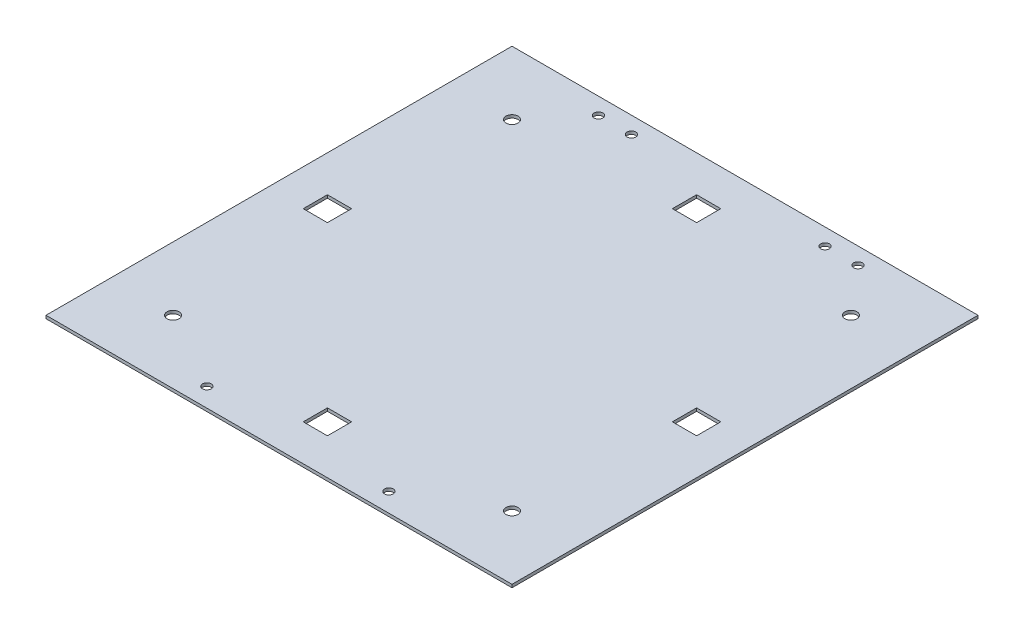
ISO-10303-21;
HEADER;
FILE_DESCRIPTION(('STEP AP214'),'2;1');
FILE_NAME('part.step','',(''),(''),'','','');
FILE_SCHEMA(('AUTOMOTIVE_DESIGN { 1 0 10303 214 1 1 1 1 }'));
ENDSEC;
DATA;
#1=APPLICATION_CONTEXT('core data for automotive mechanical design processes');
#2=APPLICATION_PROTOCOL_DEFINITION('international standard','automotive_design',2000,#1);
#3=PRODUCT_CONTEXT('',#1,'mechanical');
#4=PRODUCT('Part','Part','',(#3));
#5=PRODUCT_RELATED_PRODUCT_CATEGORY('part','',(#4));
#6=PRODUCT_DEFINITION_FORMATION('','',#4);
#7=PRODUCT_DEFINITION_CONTEXT('part definition',#1,'design');
#8=PRODUCT_DEFINITION('design','',#6,#7);
#9=PRODUCT_DEFINITION_SHAPE('','',#8);
#10=(LENGTH_UNIT() NAMED_UNIT(*) SI_UNIT(.MILLI.,.METRE.));
#11=(NAMED_UNIT(*) PLANE_ANGLE_UNIT() SI_UNIT($,.RADIAN.));
#12=(NAMED_UNIT(*) SI_UNIT($,.STERADIAN.) SOLID_ANGLE_UNIT());
#13=UNCERTAINTY_MEASURE_WITH_UNIT(LENGTH_MEASURE(1.E-05),#10,'distance_accuracy_value','');
#14=(GEOMETRIC_REPRESENTATION_CONTEXT(3) GLOBAL_UNCERTAINTY_ASSIGNED_CONTEXT((#13)) GLOBAL_UNIT_ASSIGNED_CONTEXT((#10,
#11,#12)) REPRESENTATION_CONTEXT('',''));
#15=CARTESIAN_POINT('',(0.,0.,0.));
#16=DIRECTION('',(0.,0.,1.));
#17=DIRECTION('',(1.,0.,0.));
#18=AXIS2_PLACEMENT_3D('',#15,#16,#17);
#19=CARTESIAN_POINT('',(0.,1.5875,0.));
#20=DIRECTION('',(1.,0.,0.));
#21=DIRECTION('',(0.,0.,-1.));
#22=AXIS2_PLACEMENT_3D('',#19,#20,#21);
#23=PLANE('',#22);
#24=DIRECTION('',(0.,0.,1.));
#25=VECTOR('',#24,1.);
#26=CARTESIAN_POINT('',(0.,0.,0.));
#27=LINE('',#26,#25);
#28=CARTESIAN_POINT('',(0.,0.,-244.475));
#29=VERTEX_POINT('',#28);
#30=CARTESIAN_POINT('',(0.,0.,0.));
#31=VERTEX_POINT('',#30);
#32=EDGE_CURVE('E334',#29,#31,#27,.T.);
#33=ORIENTED_EDGE('',*,*,#32,.T.);
#34=DIRECTION('',(0.,-1.,0.));
#35=VECTOR('',#34,1.);
#36=CARTESIAN_POINT('',(0.,1.5875,0.));
#37=LINE('',#36,#35);
#38=CARTESIAN_POINT('',(0.,1.5875,0.));
#39=VERTEX_POINT('',#38);
#40=EDGE_CURVE('E11',#39,#31,#37,.T.);
#41=ORIENTED_EDGE('',*,*,#40,.F.);
#42=DIRECTION('',(0.,0.,1.));
#43=VECTOR('',#42,1.);
#44=CARTESIAN_POINT('',(0.,1.5875,0.));
#45=LINE('',#44,#43);
#46=CARTESIAN_POINT('',(0.,1.5875,-244.475));
#47=VERTEX_POINT('',#46);
#48=EDGE_CURVE('E367',#47,#39,#45,.T.);
#49=ORIENTED_EDGE('',*,*,#48,.F.);
#50=DIRECTION('',(0.,-1.,0.));
#51=VECTOR('',#50,1.);
#52=CARTESIAN_POINT('',(0.,1.5875,-244.475));
#53=LINE('',#52,#51);
#54=EDGE_CURVE('E377',#47,#29,#53,.T.);
#55=ORIENTED_EDGE('',*,*,#54,.T.);
#56=EDGE_LOOP('',(#33,#41,#49,#55));
#57=FACE_BOUND('',#56,.T.);
#58=ADVANCED_FACE('F37',(#57),#23,.F.);
#59=CARTESIAN_POINT('',(0.,1.5875,0.));
#60=DIRECTION('',(0.,0.,-1.));
#61=DIRECTION('',(-1.,0.,0.));
#62=AXIS2_PLACEMENT_3D('',#59,#60,#61);
#63=PLANE('',#62);
#64=DIRECTION('',(1.,0.,0.));
#65=VECTOR('',#64,1.);
#66=CARTESIAN_POINT('',(0.,0.,0.));
#67=LINE('',#66,#65);
#68=CARTESIAN_POINT('',(244.475,0.,0.));
#69=VERTEX_POINT('',#68);
#70=EDGE_CURVE('E380',#31,#69,#67,.T.);
#71=ORIENTED_EDGE('',*,*,#70,.T.);
#72=DIRECTION('',(0.,-1.,0.));
#73=VECTOR('',#72,1.);
#74=CARTESIAN_POINT('',(244.475,1.5875,0.));
#75=LINE('',#74,#73);
#76=CARTESIAN_POINT('',(244.475,1.5875,0.));
#77=VERTEX_POINT('',#76);
#78=EDGE_CURVE('E44',#77,#69,#75,.T.);
#79=ORIENTED_EDGE('',*,*,#78,.F.);
#80=DIRECTION('',(1.,0.,0.));
#81=VECTOR('',#80,1.);
#82=CARTESIAN_POINT('',(0.,1.5875,0.));
#83=LINE('',#82,#81);
#84=EDGE_CURVE('E370',#39,#77,#83,.T.);
#85=ORIENTED_EDGE('',*,*,#84,.F.);
#86=ORIENTED_EDGE('',*,*,#40,.T.);
#87=EDGE_LOOP('',(#71,#79,#85,#86));
#88=FACE_BOUND('',#87,.T.);
#89=ADVANCED_FACE('F409',(#88),#63,.F.);
#90=CARTESIAN_POINT('',(244.475,1.5875,0.));
#91=DIRECTION('',(-1.,0.,0.));
#92=DIRECTION('',(0.,0.,1.));
#93=AXIS2_PLACEMENT_3D('',#90,#91,#92);
#94=PLANE('',#93);
#95=DIRECTION('',(0.,0.,-1.));
#96=VECTOR('',#95,1.);
#97=CARTESIAN_POINT('',(244.475,0.,0.));
#98=LINE('',#97,#96);
#99=CARTESIAN_POINT('',(244.475,0.,-244.475));
#100=VERTEX_POINT('',#99);
#101=EDGE_CURVE('E382',#69,#100,#98,.T.);
#102=ORIENTED_EDGE('',*,*,#101,.T.);
#103=DIRECTION('',(0.,-1.,0.));
#104=VECTOR('',#103,1.);
#105=CARTESIAN_POINT('',(244.475,1.5875,-244.475));
#106=LINE('',#105,#104);
#107=CARTESIAN_POINT('',(244.475,1.5875,-244.475));
#108=VERTEX_POINT('',#107);
#109=EDGE_CURVE('E387',#108,#100,#106,.T.);
#110=ORIENTED_EDGE('',*,*,#109,.F.);
#111=DIRECTION('',(0.,0.,-1.));
#112=VECTOR('',#111,1.);
#113=CARTESIAN_POINT('',(244.475,1.5875,0.));
#114=LINE('',#113,#112);
#115=EDGE_CURVE('E373',#77,#108,#114,.T.);
#116=ORIENTED_EDGE('',*,*,#115,.F.);
#117=ORIENTED_EDGE('',*,*,#78,.T.);
#118=EDGE_LOOP('',(#102,#110,#116,#117));
#119=FACE_BOUND('',#118,.T.);
#120=ADVANCED_FACE('F394',(#119),#94,.F.);
#121=CARTESIAN_POINT('',(0.,1.5875,-244.475));
#122=DIRECTION('',(0.,0.,1.));
#123=DIRECTION('',(1.,0.,0.));
#124=AXIS2_PLACEMENT_3D('',#121,#122,#123);
#125=PLANE('',#124);
#126=DIRECTION('',(-1.,0.,0.));
#127=VECTOR('',#126,1.);
#128=CARTESIAN_POINT('',(0.,0.,-244.475));
#129=LINE('',#128,#127);
#130=EDGE_CURVE('E371',#100,#29,#129,.T.);
#131=ORIENTED_EDGE('',*,*,#130,.T.);
#132=ORIENTED_EDGE('',*,*,#54,.F.);
#133=DIRECTION('',(-1.,0.,0.));
#134=VECTOR('',#133,1.);
#135=CARTESIAN_POINT('',(0.,1.5875,-244.475));
#136=LINE('',#135,#134);
#137=EDGE_CURVE('E375',#108,#47,#136,.T.);
#138=ORIENTED_EDGE('',*,*,#137,.F.);
#139=ORIENTED_EDGE('',*,*,#109,.T.);
#140=EDGE_LOOP('',(#131,#132,#138,#139));
#141=FACE_BOUND('',#140,.T.);
#142=ADVANCED_FACE('F402',(#141),#125,.F.);
#143=CARTESIAN_POINT('',(0.,1.5875,0.));
#144=DIRECTION('',(0.,-1.,0.));
#145=DIRECTION('',(0.,0.,-1.));
#146=AXIS2_PLACEMENT_3D('',#143,#144,#145);
#147=PLANE('',#146);
#148=DIRECTION('',(1.,0.,0.));
#149=VECTOR('',#148,1.);
#150=CARTESIAN_POINT('',(115.8875,1.5875,-19.05));
#151=LINE('',#150,#149);
#152=CARTESIAN_POINT('',(115.8875,1.5875,-19.05));
#153=VERTEX_POINT('',#152);
#154=CARTESIAN_POINT('',(128.5875,1.5875,-19.05));
#155=VERTEX_POINT('',#154);
#156=EDGE_CURVE('E203',#153,#155,#151,.T.);
#157=ORIENTED_EDGE('',*,*,#156,.F.);
#158=DIRECTION('',(0.,0.,1.));
#159=VECTOR('',#158,1.);
#160=CARTESIAN_POINT('',(115.8875,1.5875,-31.75));
#161=LINE('',#160,#159);
#162=CARTESIAN_POINT('',(115.8875,1.5875,-31.75));
#163=VERTEX_POINT('',#162);
#164=EDGE_CURVE('E51',#163,#153,#161,.T.);
#165=ORIENTED_EDGE('',*,*,#164,.F.);
#166=DIRECTION('',(-1.,0.,0.));
#167=VECTOR('',#166,1.);
#168=CARTESIAN_POINT('',(115.8875,1.5875,-31.75));
#169=LINE('',#168,#167);
#170=CARTESIAN_POINT('',(128.5875,1.5875,-31.75));
#171=VERTEX_POINT('',#170);
#172=EDGE_CURVE('E194',#171,#163,#169,.T.);
#173=ORIENTED_EDGE('',*,*,#172,.F.);
#174=DIRECTION('',(0.,0.,-1.));
#175=VECTOR('',#174,1.);
#176=CARTESIAN_POINT('',(128.5875,1.5875,-31.75));
#177=LINE('',#176,#175);
#178=EDGE_CURVE('E197',#155,#171,#177,.T.);
#179=ORIENTED_EDGE('',*,*,#178,.F.);
#180=EDGE_LOOP('',(#157,#165,#173,#179));
#181=FACE_BOUND('',#180,.T.);
#182=DIRECTION('',(-1.,0.,0.));
#183=VECTOR('',#182,1.);
#184=CARTESIAN_POINT('',(31.75,1.5875,-128.5875));
#185=LINE('',#184,#183);
#186=CARTESIAN_POINT('',(31.75,1.5875,-128.5875));
#187=VERTEX_POINT('',#186);
#188=CARTESIAN_POINT('',(19.05,1.5875,-128.5875));
#189=VERTEX_POINT('',#188);
#190=EDGE_CURVE('E229',#187,#189,#185,.T.);
#191=ORIENTED_EDGE('',*,*,#190,.F.);
#192=DIRECTION('',(0.,0.,-1.));
#193=VECTOR('',#192,1.);
#194=CARTESIAN_POINT('',(31.75,1.5875,-128.5875));
#195=LINE('',#194,#193);
#196=CARTESIAN_POINT('',(31.75,1.5875,-115.8875));
#197=VERTEX_POINT('',#196);
#198=EDGE_CURVE('E59',#197,#187,#195,.T.);
#199=ORIENTED_EDGE('',*,*,#198,.F.);
#200=DIRECTION('',(1.,0.,0.));
#201=VECTOR('',#200,1.);
#202=CARTESIAN_POINT('',(31.75,1.5875,-115.8875));
#203=LINE('',#202,#201);
#204=CARTESIAN_POINT('',(19.05,1.5875,-115.8875));
#205=VERTEX_POINT('',#204);
#206=EDGE_CURVE('E218',#205,#197,#203,.T.);
#207=ORIENTED_EDGE('',*,*,#206,.F.);
#208=DIRECTION('',(0.,0.,1.));
#209=VECTOR('',#208,1.);
#210=CARTESIAN_POINT('',(19.05,1.5875,-128.5875));
#211=LINE('',#210,#209);
#212=EDGE_CURVE('E233',#189,#205,#211,.T.);
#213=ORIENTED_EDGE('',*,*,#212,.F.);
#214=EDGE_LOOP('',(#191,#199,#207,#213));
#215=FACE_BOUND('',#214,.T.);
#216=DIRECTION('',(0.,0.,-1.));
#217=VECTOR('',#216,1.);
#218=CARTESIAN_POINT('',(128.5875,1.5875,-212.725));
#219=LINE('',#218,#217);
#220=CARTESIAN_POINT('',(128.5875,1.5875,-212.725));
#221=VERTEX_POINT('',#220);
#222=CARTESIAN_POINT('',(128.5875,1.5875,-225.425));
#223=VERTEX_POINT('',#222);
#224=EDGE_CURVE('E260',#221,#223,#219,.T.);
#225=ORIENTED_EDGE('',*,*,#224,.F.);
#226=DIRECTION('',(1.,0.,0.));
#227=VECTOR('',#226,1.);
#228=CARTESIAN_POINT('',(128.5875,1.5875,-212.725));
#229=LINE('',#228,#227);
#230=CARTESIAN_POINT('',(115.8875,1.5875,-212.725));
#231=VERTEX_POINT('',#230);
#232=EDGE_CURVE('E258',#231,#221,#229,.T.);
#233=ORIENTED_EDGE('',*,*,#232,.F.);
#234=DIRECTION('',(0.,0.,1.));
#235=VECTOR('',#234,1.);
#236=CARTESIAN_POINT('',(115.8875,1.5875,-212.725));
#237=LINE('',#236,#235);
#238=CARTESIAN_POINT('',(115.8875,1.5875,-225.425));
#239=VERTEX_POINT('',#238);
#240=EDGE_CURVE('E248',#239,#231,#237,.T.);
#241=ORIENTED_EDGE('',*,*,#240,.F.);
#242=DIRECTION('',(-1.,0.,0.));
#243=VECTOR('',#242,1.);
#244=CARTESIAN_POINT('',(128.5875,1.5875,-225.425));
#245=LINE('',#244,#243);
#246=EDGE_CURVE('E264',#223,#239,#245,.T.);
#247=ORIENTED_EDGE('',*,*,#246,.F.);
#248=EDGE_LOOP('',(#225,#233,#241,#247));
#249=FACE_BOUND('',#248,.T.);
#250=DIRECTION('',(1.,0.,0.));
#251=VECTOR('',#250,1.);
#252=CARTESIAN_POINT('',(212.725,1.5875,-115.8875));
#253=LINE('',#252,#251);
#254=CARTESIAN_POINT('',(212.725,1.5875,-115.8875));
#255=VERTEX_POINT('',#254);
#256=CARTESIAN_POINT('',(225.425,1.5875,-115.8875));
#257=VERTEX_POINT('',#256);
#258=EDGE_CURVE('E292',#255,#257,#253,.T.);
#259=ORIENTED_EDGE('',*,*,#258,.F.);
#260=DIRECTION('',(0.,0.,1.));
#261=VECTOR('',#260,1.);
#262=CARTESIAN_POINT('',(212.725,1.5875,-115.8875));
#263=LINE('',#262,#261);
#264=CARTESIAN_POINT('',(212.725,1.5875,-128.5875));
#265=VERTEX_POINT('',#264);
#266=EDGE_CURVE('E290',#265,#255,#263,.T.);
#267=ORIENTED_EDGE('',*,*,#266,.F.);
#268=DIRECTION('',(-1.,0.,0.));
#269=VECTOR('',#268,1.);
#270=CARTESIAN_POINT('',(212.725,1.5875,-128.5875));
#271=LINE('',#270,#269);
#272=CARTESIAN_POINT('',(225.425,1.5875,-128.5875));
#273=VERTEX_POINT('',#272);
#274=EDGE_CURVE('E280',#273,#265,#271,.T.);
#275=ORIENTED_EDGE('',*,*,#274,.F.);
#276=DIRECTION('',(0.,0.,-1.));
#277=VECTOR('',#276,1.);
#278=CARTESIAN_POINT('',(225.425,1.5875,-115.8875));
#279=LINE('',#278,#277);
#280=EDGE_CURVE('E295',#257,#273,#279,.T.);
#281=ORIENTED_EDGE('',*,*,#280,.F.);
#282=EDGE_LOOP('',(#259,#267,#275,#281));
#283=FACE_BOUND('',#282,.T.);
#284=CARTESIAN_POINT('',(211.1375,1.5875,-211.1375));
#285=DIRECTION('',(0.,1.,0.));
#286=DIRECTION('',(0.,0.,1.));
#287=AXIS2_PLACEMENT_3D('',#284,#285,#286);
#288=CIRCLE('',#287,3.17499999999997);
#289=CARTESIAN_POINT('',(211.1375,1.5875,-207.9625));
#290=VERTEX_POINT('',#289);
#291=EDGE_CURVE('E317',#290,#290,#288,.T.);
#292=ORIENTED_EDGE('',*,*,#291,.F.);
#293=EDGE_LOOP('',(#292));
#294=FACE_BOUND('',#293,.T.);
#295=CARTESIAN_POINT('',(33.3375,1.5875,-33.3375));
#296=DIRECTION('',(0.,1.,0.));
#297=DIRECTION('',(0.,0.,1.));
#298=AXIS2_PLACEMENT_3D('',#295,#296,#297);
#299=CIRCLE('',#298,3.17499999999997);
#300=CARTESIAN_POINT('',(33.3375,1.5875,-30.1625));
#301=VERTEX_POINT('',#300);
#302=EDGE_CURVE('E310',#301,#301,#299,.T.);
#303=ORIENTED_EDGE('',*,*,#302,.F.);
#304=EDGE_LOOP('',(#303));
#305=FACE_BOUND('',#304,.T.);
#306=CARTESIAN_POINT('',(211.1375,1.5875,-33.3375));
#307=DIRECTION('',(0.,1.,0.));
#308=DIRECTION('',(0.,0.,1.));
#309=AXIS2_PLACEMENT_3D('',#306,#307,#308);
#310=CIRCLE('',#309,3.17499999999997);
#311=CARTESIAN_POINT('',(211.1375,1.5875,-30.1625));
#312=VERTEX_POINT('',#311);
#313=EDGE_CURVE('E210',#312,#312,#310,.T.);
#314=ORIENTED_EDGE('',*,*,#313,.F.);
#315=EDGE_LOOP('',(#314));
#316=FACE_BOUND('',#315,.T.);
#317=CARTESIAN_POINT('',(33.3375,1.5875,-211.1375));
#318=DIRECTION('',(0.,1.,0.));
#319=DIRECTION('',(0.,0.,1.));
#320=AXIS2_PLACEMENT_3D('',#317,#318,#319);
#321=CIRCLE('',#320,3.17499999999997);
#322=CARTESIAN_POINT('',(33.3375,1.5875,-207.9625));
#323=VERTEX_POINT('',#322);
#324=EDGE_CURVE('E316',#323,#323,#321,.T.);
#325=ORIENTED_EDGE('',*,*,#324,.F.);
#326=EDGE_LOOP('',(#325));
#327=FACE_BOUND('',#326,.T.);
#328=CARTESIAN_POINT('',(54.1655,1.5875,-235.6866));
#329=DIRECTION('',(0.,1.,0.));
#330=DIRECTION('',(0.,0.,1.));
#331=AXIS2_PLACEMENT_3D('',#328,#329,#330);
#332=CIRCLE('',#331,2.28599999999996);
#333=CARTESIAN_POINT('',(54.1655,1.5875,-233.4006));
#334=VERTEX_POINT('',#333);
#335=EDGE_CURVE('E335',#334,#334,#332,.T.);
#336=ORIENTED_EDGE('',*,*,#335,.F.);
#337=EDGE_LOOP('',(#336));
#338=FACE_BOUND('',#337,.T.);
#339=CARTESIAN_POINT('',(169.9895,1.5875,-9.906));
#340=DIRECTION('',(0.,1.,0.));
#341=DIRECTION('',(0.,0.,1.));
#342=AXIS2_PLACEMENT_3D('',#339,#340,#341);
#343=CIRCLE('',#342,2.28600000000004);
#344=CARTESIAN_POINT('',(169.9895,1.5875,-7.61999999999996));
#345=VERTEX_POINT('',#344);
#346=EDGE_CURVE('E328',#345,#345,#343,.T.);
#347=ORIENTED_EDGE('',*,*,#346,.F.);
#348=EDGE_LOOP('',(#347));
#349=FACE_BOUND('',#348,.T.);
#350=CARTESIAN_POINT('',(71.4375,1.5875,-235.6866));
#351=DIRECTION('',(0.,1.,0.));
#352=DIRECTION('',(0.,0.,1.));
#353=AXIS2_PLACEMENT_3D('',#350,#351,#352);
#354=CIRCLE('',#353,2.28599999999999);
#355=CARTESIAN_POINT('',(71.4375,1.5875,-233.4006));
#356=VERTEX_POINT('',#355);
#357=EDGE_CURVE('E359',#356,#356,#354,.T.);
#358=ORIENTED_EDGE('',*,*,#357,.F.);
#359=EDGE_LOOP('',(#358));
#360=FACE_BOUND('',#359,.T.);
#361=CARTESIAN_POINT('',(173.0375,1.5875,-235.6866));
#362=DIRECTION('',(0.,1.,0.));
#363=DIRECTION('',(0.,0.,1.));
#364=AXIS2_PLACEMENT_3D('',#361,#362,#363);
#365=CIRCLE('',#364,2.28600000000001);
#366=CARTESIAN_POINT('',(173.0375,1.5875,-233.4006));
#367=VERTEX_POINT('',#366);
#368=EDGE_CURVE('E348',#367,#367,#365,.T.);
#369=ORIENTED_EDGE('',*,*,#368,.F.);
#370=EDGE_LOOP('',(#369));
#371=FACE_BOUND('',#370,.T.);
#372=CARTESIAN_POINT('',(190.3095,1.5875,-235.6866));
#373=DIRECTION('',(0.,1.,0.));
#374=DIRECTION('',(0.,0.,1.));
#375=AXIS2_PLACEMENT_3D('',#372,#373,#374);
#376=CIRCLE('',#375,2.28600000000001);
#377=CARTESIAN_POINT('',(190.3095,1.5875,-233.4006));
#378=VERTEX_POINT('',#377);
#379=EDGE_CURVE('E349',#378,#378,#376,.T.);
#380=ORIENTED_EDGE('',*,*,#379,.F.);
#381=EDGE_LOOP('',(#380));
#382=FACE_BOUND('',#381,.T.);
#383=CARTESIAN_POINT('',(74.4855,1.5875,-9.906));
#384=DIRECTION('',(0.,1.,0.));
#385=DIRECTION('',(0.,0.,1.));
#386=AXIS2_PLACEMENT_3D('',#383,#384,#385);
#387=CIRCLE('',#386,2.28599999999999);
#388=CARTESIAN_POINT('',(74.4855,1.5875,-7.62000000000001));
#389=VERTEX_POINT('',#388);
#390=EDGE_CURVE('E342',#389,#389,#387,.T.);
#391=ORIENTED_EDGE('',*,*,#390,.F.);
#392=EDGE_LOOP('',(#391));
#393=FACE_BOUND('',#392,.T.);
#394=ORIENTED_EDGE('',*,*,#48,.T.);
#395=ORIENTED_EDGE('',*,*,#84,.T.);
#396=ORIENTED_EDGE('',*,*,#115,.T.);
#397=ORIENTED_EDGE('',*,*,#137,.T.);
#398=EDGE_LOOP('',(#394,#395,#396,#397));
#399=FACE_BOUND('',#398,.T.);
#400=ADVANCED_FACE('F408',(#181,#215,#249,#283,#294,#305,#316,#327,#338,#349,#360,#371,#382,
#393,#399),#147,.F.);
#401=CARTESIAN_POINT('',(0.,0.,0.));
#402=DIRECTION('',(0.,-1.,0.));
#403=DIRECTION('',(0.,0.,-1.));
#404=AXIS2_PLACEMENT_3D('',#401,#402,#403);
#405=PLANE('',#404);
#406=DIRECTION('',(0.,0.,1.));
#407=VECTOR('',#406,1.);
#408=CARTESIAN_POINT('',(115.8875,0.,-31.75));
#409=LINE('',#408,#407);
#410=CARTESIAN_POINT('',(115.8875,0.,-31.75));
#411=VERTEX_POINT('',#410);
#412=CARTESIAN_POINT('',(115.8875,0.,-19.05));
#413=VERTEX_POINT('',#412);
#414=EDGE_CURVE('E175',#411,#413,#409,.T.);
#415=ORIENTED_EDGE('',*,*,#414,.T.);
#416=DIRECTION('',(1.,0.,0.));
#417=VECTOR('',#416,1.);
#418=CARTESIAN_POINT('',(115.8875,0.,-19.05));
#419=LINE('',#418,#417);
#420=CARTESIAN_POINT('',(128.5875,0.,-19.05));
#421=VERTEX_POINT('',#420);
#422=EDGE_CURVE('E185',#413,#421,#419,.T.);
#423=ORIENTED_EDGE('',*,*,#422,.T.);
#424=DIRECTION('',(0.,0.,-1.));
#425=VECTOR('',#424,1.);
#426=CARTESIAN_POINT('',(128.5875,0.,-31.75));
#427=LINE('',#426,#425);
#428=CARTESIAN_POINT('',(128.5875,0.,-31.75));
#429=VERTEX_POINT('',#428);
#430=EDGE_CURVE('E189',#421,#429,#427,.T.);
#431=ORIENTED_EDGE('',*,*,#430,.T.);
#432=DIRECTION('',(-1.,0.,0.));
#433=VECTOR('',#432,1.);
#434=CARTESIAN_POINT('',(115.8875,0.,-31.75));
#435=LINE('',#434,#433);
#436=EDGE_CURVE('E181',#429,#411,#435,.T.);
#437=ORIENTED_EDGE('',*,*,#436,.T.);
#438=EDGE_LOOP('',(#415,#423,#431,#437));
#439=FACE_BOUND('',#438,.T.);
#440=DIRECTION('',(0.,0.,-1.));
#441=VECTOR('',#440,1.);
#442=CARTESIAN_POINT('',(31.75,0.,-128.5875));
#443=LINE('',#442,#441);
#444=CARTESIAN_POINT('',(31.75,0.,-115.8875));
#445=VERTEX_POINT('',#444);
#446=CARTESIAN_POINT('',(31.75,0.,-128.5875));
#447=VERTEX_POINT('',#446);
#448=EDGE_CURVE('E214',#445,#447,#443,.T.);
#449=ORIENTED_EDGE('',*,*,#448,.T.);
#450=DIRECTION('',(-1.,0.,0.));
#451=VECTOR('',#450,1.);
#452=CARTESIAN_POINT('',(31.75,0.,-128.5875));
#453=LINE('',#452,#451);
#454=CARTESIAN_POINT('',(19.05,0.,-128.5875));
#455=VERTEX_POINT('',#454);
#456=EDGE_CURVE('E217',#447,#455,#453,.T.);
#457=ORIENTED_EDGE('',*,*,#456,.T.);
#458=DIRECTION('',(0.,0.,1.));
#459=VECTOR('',#458,1.);
#460=CARTESIAN_POINT('',(19.05,0.,-128.5875));
#461=LINE('',#460,#459);
#462=CARTESIAN_POINT('',(19.05,0.,-115.8875));
#463=VERTEX_POINT('',#462);
#464=EDGE_CURVE('E221',#455,#463,#461,.T.);
#465=ORIENTED_EDGE('',*,*,#464,.T.);
#466=DIRECTION('',(1.,0.,0.));
#467=VECTOR('',#466,1.);
#468=CARTESIAN_POINT('',(31.75,0.,-115.8875));
#469=LINE('',#468,#467);
#470=EDGE_CURVE('E224',#463,#445,#469,.T.);
#471=ORIENTED_EDGE('',*,*,#470,.T.);
#472=EDGE_LOOP('',(#449,#457,#465,#471));
#473=FACE_BOUND('',#472,.T.);
#474=DIRECTION('',(1.,0.,0.));
#475=VECTOR('',#474,1.);
#476=CARTESIAN_POINT('',(128.5875,0.,-212.725));
#477=LINE('',#476,#475);
#478=CARTESIAN_POINT('',(115.8875,0.,-212.725));
#479=VERTEX_POINT('',#478);
#480=CARTESIAN_POINT('',(128.5875,0.,-212.725));
#481=VERTEX_POINT('',#480);
#482=EDGE_CURVE('E244',#479,#481,#477,.T.);
#483=ORIENTED_EDGE('',*,*,#482,.T.);
#484=DIRECTION('',(0.,0.,-1.));
#485=VECTOR('',#484,1.);
#486=CARTESIAN_POINT('',(128.5875,0.,-212.725));
#487=LINE('',#486,#485);
#488=CARTESIAN_POINT('',(128.5875,0.,-225.425));
#489=VERTEX_POINT('',#488);
#490=EDGE_CURVE('E247',#481,#489,#487,.T.);
#491=ORIENTED_EDGE('',*,*,#490,.T.);
#492=DIRECTION('',(-1.,0.,0.));
#493=VECTOR('',#492,1.);
#494=CARTESIAN_POINT('',(128.5875,0.,-225.425));
#495=LINE('',#494,#493);
#496=CARTESIAN_POINT('',(115.8875,0.,-225.425));
#497=VERTEX_POINT('',#496);
#498=EDGE_CURVE('E251',#489,#497,#495,.T.);
#499=ORIENTED_EDGE('',*,*,#498,.T.);
#500=DIRECTION('',(0.,0.,1.));
#501=VECTOR('',#500,1.);
#502=CARTESIAN_POINT('',(115.8875,0.,-212.725));
#503=LINE('',#502,#501);
#504=EDGE_CURVE('E254',#497,#479,#503,.T.);
#505=ORIENTED_EDGE('',*,*,#504,.T.);
#506=EDGE_LOOP('',(#483,#491,#499,#505));
#507=FACE_BOUND('',#506,.T.);
#508=DIRECTION('',(0.,0.,1.));
#509=VECTOR('',#508,1.);
#510=CARTESIAN_POINT('',(212.725,0.,-115.8875));
#511=LINE('',#510,#509);
#512=CARTESIAN_POINT('',(212.725,0.,-128.5875));
#513=VERTEX_POINT('',#512);
#514=CARTESIAN_POINT('',(212.725,0.,-115.8875));
#515=VERTEX_POINT('',#514);
#516=EDGE_CURVE('E276',#513,#515,#511,.T.);
#517=ORIENTED_EDGE('',*,*,#516,.T.);
#518=DIRECTION('',(1.,0.,0.));
#519=VECTOR('',#518,1.);
#520=CARTESIAN_POINT('',(212.725,0.,-115.8875));
#521=LINE('',#520,#519);
#522=CARTESIAN_POINT('',(225.425,0.,-115.8875));
#523=VERTEX_POINT('',#522);
#524=EDGE_CURVE('E279',#515,#523,#521,.T.);
#525=ORIENTED_EDGE('',*,*,#524,.T.);
#526=DIRECTION('',(0.,0.,-1.));
#527=VECTOR('',#526,1.);
#528=CARTESIAN_POINT('',(225.425,0.,-115.8875));
#529=LINE('',#528,#527);
#530=CARTESIAN_POINT('',(225.425,0.,-128.5875));
#531=VERTEX_POINT('',#530);
#532=EDGE_CURVE('E283',#523,#531,#529,.T.);
#533=ORIENTED_EDGE('',*,*,#532,.T.);
#534=DIRECTION('',(-1.,0.,0.));
#535=VECTOR('',#534,1.);
#536=CARTESIAN_POINT('',(212.725,0.,-128.5875));
#537=LINE('',#536,#535);
#538=EDGE_CURVE('E286',#531,#513,#537,.T.);
#539=ORIENTED_EDGE('',*,*,#538,.T.);
#540=EDGE_LOOP('',(#517,#525,#533,#539));
#541=FACE_BOUND('',#540,.T.);
#542=CARTESIAN_POINT('',(211.1375,0.,-211.1375));
#543=DIRECTION('',(0.,1.,0.));
#544=DIRECTION('',(0.,0.,1.));
#545=AXIS2_PLACEMENT_3D('',#542,#543,#544);
#546=CIRCLE('',#545,3.17499999999997);
#547=CARTESIAN_POINT('',(211.1375,0.,-207.9625));
#548=VERTEX_POINT('',#547);
#549=EDGE_CURVE('E313',#548,#548,#546,.T.);
#550=ORIENTED_EDGE('',*,*,#549,.T.);
#551=EDGE_LOOP('',(#550));
#552=FACE_BOUND('',#551,.T.);
#553=CARTESIAN_POINT('',(33.3375,0.,-33.3375));
#554=DIRECTION('',(0.,1.,0.));
#555=DIRECTION('',(0.,0.,1.));
#556=AXIS2_PLACEMENT_3D('',#553,#554,#555);
#557=CIRCLE('',#556,3.17499999999997);
#558=CARTESIAN_POINT('',(33.3375,0.,-30.1625));
#559=VERTEX_POINT('',#558);
#560=EDGE_CURVE('E320',#559,#559,#557,.T.);
#561=ORIENTED_EDGE('',*,*,#560,.T.);
#562=EDGE_LOOP('',(#561));
#563=FACE_BOUND('',#562,.T.);
#564=CARTESIAN_POINT('',(211.1375,0.,-33.3375));
#565=DIRECTION('',(0.,1.,0.));
#566=DIRECTION('',(0.,0.,1.));
#567=AXIS2_PLACEMENT_3D('',#564,#565,#566);
#568=CIRCLE('',#567,3.17499999999997);
#569=CARTESIAN_POINT('',(211.1375,0.,-30.1625));
#570=VERTEX_POINT('',#569);
#571=EDGE_CURVE('E307',#570,#570,#568,.T.);
#572=ORIENTED_EDGE('',*,*,#571,.T.);
#573=EDGE_LOOP('',(#572));
#574=FACE_BOUND('',#573,.T.);
#575=CARTESIAN_POINT('',(33.3375,0.,-211.1375));
#576=DIRECTION('',(0.,1.,0.));
#577=DIRECTION('',(0.,0.,1.));
#578=AXIS2_PLACEMENT_3D('',#575,#576,#577);
#579=CIRCLE('',#578,3.17499999999997);
#580=CARTESIAN_POINT('',(33.3375,0.,-207.9625));
#581=VERTEX_POINT('',#580);
#582=EDGE_CURVE('E325',#581,#581,#579,.T.);
#583=ORIENTED_EDGE('',*,*,#582,.T.);
#584=EDGE_LOOP('',(#583));
#585=FACE_BOUND('',#584,.T.);
#586=CARTESIAN_POINT('',(54.1655,0.,-235.6866));
#587=DIRECTION('',(0.,1.,0.));
#588=DIRECTION('',(0.,0.,1.));
#589=AXIS2_PLACEMENT_3D('',#586,#587,#588);
#590=CIRCLE('',#589,2.28599999999996);
#591=CARTESIAN_POINT('',(54.1655,0.,-233.4006));
#592=VERTEX_POINT('',#591);
#593=EDGE_CURVE('E331',#592,#592,#590,.T.);
#594=ORIENTED_EDGE('',*,*,#593,.T.);
#595=EDGE_LOOP('',(#594));
#596=FACE_BOUND('',#595,.T.);
#597=CARTESIAN_POINT('',(169.9895,0.,-9.906));
#598=DIRECTION('',(0.,1.,0.));
#599=DIRECTION('',(0.,0.,1.));
#600=AXIS2_PLACEMENT_3D('',#597,#598,#599);
#601=CIRCLE('',#600,2.28600000000004);
#602=CARTESIAN_POINT('',(169.9895,0.,-7.61999999999996));
#603=VERTEX_POINT('',#602);
#604=EDGE_CURVE('E339',#603,#603,#601,.T.);
#605=ORIENTED_EDGE('',*,*,#604,.T.);
#606=EDGE_LOOP('',(#605));
#607=FACE_BOUND('',#606,.T.);
#608=CARTESIAN_POINT('',(71.4375,0.,-235.6866));
#609=DIRECTION('',(0.,1.,0.));
#610=DIRECTION('',(0.,0.,1.));
#611=AXIS2_PLACEMENT_3D('',#608,#609,#610);
#612=CIRCLE('',#611,2.28599999999999);
#613=CARTESIAN_POINT('',(71.4375,0.,-233.4006));
#614=VERTEX_POINT('',#613);
#615=EDGE_CURVE('E338',#614,#614,#612,.T.);
#616=ORIENTED_EDGE('',*,*,#615,.T.);
#617=EDGE_LOOP('',(#616));
#618=FACE_BOUND('',#617,.T.);
#619=CARTESIAN_POINT('',(173.0375,0.,-235.6866));
#620=DIRECTION('',(0.,1.,0.));
#621=DIRECTION('',(0.,0.,1.));
#622=AXIS2_PLACEMENT_3D('',#619,#620,#621);
#623=CIRCLE('',#622,2.28600000000001);
#624=CARTESIAN_POINT('',(173.0375,0.,-233.4006));
#625=VERTEX_POINT('',#624);
#626=EDGE_CURVE('E362',#625,#625,#623,.T.);
#627=ORIENTED_EDGE('',*,*,#626,.T.);
#628=EDGE_LOOP('',(#627));
#629=FACE_BOUND('',#628,.T.);
#630=CARTESIAN_POINT('',(190.3095,0.,-235.6866));
#631=DIRECTION('',(0.,1.,0.));
#632=DIRECTION('',(0.,0.,1.));
#633=AXIS2_PLACEMENT_3D('',#630,#631,#632);
#634=CIRCLE('',#633,2.28600000000001);
#635=CARTESIAN_POINT('',(190.3095,0.,-233.4006));
#636=VERTEX_POINT('',#635);
#637=EDGE_CURVE('E345',#636,#636,#634,.T.);
#638=ORIENTED_EDGE('',*,*,#637,.T.);
#639=EDGE_LOOP('',(#638));
#640=FACE_BOUND('',#639,.T.);
#641=CARTESIAN_POINT('',(74.4855,0.,-9.906));
#642=DIRECTION('',(0.,1.,0.));
#643=DIRECTION('',(0.,0.,1.));
#644=AXIS2_PLACEMENT_3D('',#641,#642,#643);
#645=CIRCLE('',#644,2.28599999999999);
#646=CARTESIAN_POINT('',(74.4855,0.,-7.62000000000001));
#647=VERTEX_POINT('',#646);
#648=EDGE_CURVE('E352',#647,#647,#645,.T.);
#649=ORIENTED_EDGE('',*,*,#648,.T.);
#650=EDGE_LOOP('',(#649));
#651=FACE_BOUND('',#650,.T.);
#652=ORIENTED_EDGE('',*,*,#32,.F.);
#653=ORIENTED_EDGE('',*,*,#130,.F.);
#654=ORIENTED_EDGE('',*,*,#101,.F.);
#655=ORIENTED_EDGE('',*,*,#70,.F.);
#656=EDGE_LOOP('',(#652,#653,#654,#655));
#657=FACE_BOUND('',#656,.T.);
#658=ADVANCED_FACE('F191',(#439,#473,#507,#541,#552,#563,#574,#585,#596,#607,#618,#629,#640,
#651,#657),#405,.T.);
#659=CARTESIAN_POINT('',(74.4855,0.,-9.906));
#660=DIRECTION('',(0.,1.,0.));
#661=DIRECTION('',(0.,0.,1.));
#662=AXIS2_PLACEMENT_3D('',#659,#660,#661);
#663=CYLINDRICAL_SURFACE('',#662,2.28599999999999);
#664=ORIENTED_EDGE('',*,*,#648,.F.);
#665=EDGE_LOOP('',(#664));
#666=FACE_BOUND('',#665,.T.);
#667=ORIENTED_EDGE('',*,*,#390,.T.);
#668=EDGE_LOOP('',(#667));
#669=FACE_BOUND('',#668,.T.);
#670=ADVANCED_FACE('F421',(#666,#669),#663,.F.);
#671=CARTESIAN_POINT('',(190.3095,0.,-235.6866));
#672=DIRECTION('',(0.,1.,0.));
#673=DIRECTION('',(0.,0.,1.));
#674=AXIS2_PLACEMENT_3D('',#671,#672,#673);
#675=CYLINDRICAL_SURFACE('',#674,2.28600000000001);
#676=ORIENTED_EDGE('',*,*,#637,.F.);
#677=EDGE_LOOP('',(#676));
#678=FACE_BOUND('',#677,.T.);
#679=ORIENTED_EDGE('',*,*,#379,.T.);
#680=EDGE_LOOP('',(#679));
#681=FACE_BOUND('',#680,.T.);
#682=ADVANCED_FACE('F429',(#678,#681),#675,.F.);
#683=CARTESIAN_POINT('',(173.0375,0.,-235.6866));
#684=DIRECTION('',(0.,1.,0.));
#685=DIRECTION('',(0.,0.,1.));
#686=AXIS2_PLACEMENT_3D('',#683,#684,#685);
#687=CYLINDRICAL_SURFACE('',#686,2.28600000000001);
#688=ORIENTED_EDGE('',*,*,#626,.F.);
#689=EDGE_LOOP('',(#688));
#690=FACE_BOUND('',#689,.T.);
#691=ORIENTED_EDGE('',*,*,#368,.T.);
#692=EDGE_LOOP('',(#691));
#693=FACE_BOUND('',#692,.T.);
#694=ADVANCED_FACE('F425',(#690,#693),#687,.F.);
#695=CARTESIAN_POINT('',(71.4375,0.,-235.6866));
#696=DIRECTION('',(0.,1.,0.));
#697=DIRECTION('',(0.,0.,1.));
#698=AXIS2_PLACEMENT_3D('',#695,#696,#697);
#699=CYLINDRICAL_SURFACE('',#698,2.28599999999999);
#700=ORIENTED_EDGE('',*,*,#615,.F.);
#701=EDGE_LOOP('',(#700));
#702=FACE_BOUND('',#701,.T.);
#703=ORIENTED_EDGE('',*,*,#357,.T.);
#704=EDGE_LOOP('',(#703));
#705=FACE_BOUND('',#704,.T.);
#706=ADVANCED_FACE('F428',(#702,#705),#699,.F.);
#707=CARTESIAN_POINT('',(169.9895,0.,-9.906));
#708=DIRECTION('',(0.,1.,0.));
#709=DIRECTION('',(0.,0.,1.));
#710=AXIS2_PLACEMENT_3D('',#707,#708,#709);
#711=CYLINDRICAL_SURFACE('',#710,2.28600000000004);
#712=ORIENTED_EDGE('',*,*,#604,.F.);
#713=EDGE_LOOP('',(#712));
#714=FACE_BOUND('',#713,.T.);
#715=ORIENTED_EDGE('',*,*,#346,.T.);
#716=EDGE_LOOP('',(#715));
#717=FACE_BOUND('',#716,.T.);
#718=ADVANCED_FACE('F433',(#714,#717),#711,.F.);
#719=CARTESIAN_POINT('',(54.1655,0.,-235.6866));
#720=DIRECTION('',(0.,1.,0.));
#721=DIRECTION('',(0.,0.,1.));
#722=AXIS2_PLACEMENT_3D('',#719,#720,#721);
#723=CYLINDRICAL_SURFACE('',#722,2.28599999999996);
#724=ORIENTED_EDGE('',*,*,#593,.F.);
#725=EDGE_LOOP('',(#724));
#726=FACE_BOUND('',#725,.T.);
#727=ORIENTED_EDGE('',*,*,#335,.T.);
#728=EDGE_LOOP('',(#727));
#729=FACE_BOUND('',#728,.T.);
#730=ADVANCED_FACE('F443',(#726,#729),#723,.F.);
#731=CARTESIAN_POINT('',(33.3375,0.,-211.1375));
#732=DIRECTION('',(0.,1.,0.));
#733=DIRECTION('',(0.,0.,1.));
#734=AXIS2_PLACEMENT_3D('',#731,#732,#733);
#735=CYLINDRICAL_SURFACE('',#734,3.17499999999997);
#736=ORIENTED_EDGE('',*,*,#582,.F.);
#737=EDGE_LOOP('',(#736));
#738=FACE_BOUND('',#737,.T.);
#739=ORIENTED_EDGE('',*,*,#324,.T.);
#740=EDGE_LOOP('',(#739));
#741=FACE_BOUND('',#740,.T.);
#742=ADVANCED_FACE('F447',(#738,#741),#735,.F.);
#743=CARTESIAN_POINT('',(211.1375,0.,-33.3375));
#744=DIRECTION('',(0.,1.,0.));
#745=DIRECTION('',(0.,0.,1.));
#746=AXIS2_PLACEMENT_3D('',#743,#744,#745);
#747=CYLINDRICAL_SURFACE('',#746,3.17499999999997);
#748=ORIENTED_EDGE('',*,*,#571,.F.);
#749=EDGE_LOOP('',(#748));
#750=FACE_BOUND('',#749,.T.);
#751=ORIENTED_EDGE('',*,*,#313,.T.);
#752=EDGE_LOOP('',(#751));
#753=FACE_BOUND('',#752,.T.);
#754=ADVANCED_FACE('F451',(#750,#753),#747,.F.);
#755=CARTESIAN_POINT('',(33.3375,0.,-33.3375));
#756=DIRECTION('',(0.,1.,0.));
#757=DIRECTION('',(0.,0.,1.));
#758=AXIS2_PLACEMENT_3D('',#755,#756,#757);
#759=CYLINDRICAL_SURFACE('',#758,3.17499999999997);
#760=ORIENTED_EDGE('',*,*,#560,.F.);
#761=EDGE_LOOP('',(#760));
#762=FACE_BOUND('',#761,.T.);
#763=ORIENTED_EDGE('',*,*,#302,.T.);
#764=EDGE_LOOP('',(#763));
#765=FACE_BOUND('',#764,.T.);
#766=ADVANCED_FACE('F453',(#762,#765),#759,.F.);
#767=CARTESIAN_POINT('',(211.1375,0.,-211.1375));
#768=DIRECTION('',(0.,1.,0.));
#769=DIRECTION('',(0.,0.,1.));
#770=AXIS2_PLACEMENT_3D('',#767,#768,#769);
#771=CYLINDRICAL_SURFACE('',#770,3.17499999999997);
#772=ORIENTED_EDGE('',*,*,#549,.F.);
#773=EDGE_LOOP('',(#772));
#774=FACE_BOUND('',#773,.T.);
#775=ORIENTED_EDGE('',*,*,#291,.T.);
#776=EDGE_LOOP('',(#775));
#777=FACE_BOUND('',#776,.T.);
#778=ADVANCED_FACE('F456',(#774,#777),#771,.F.);
#779=CARTESIAN_POINT('',(212.725,0.,-115.8875));
#780=DIRECTION('',(-1.,0.,0.));
#781=DIRECTION('',(0.,0.,1.));
#782=AXIS2_PLACEMENT_3D('',#779,#780,#781);
#783=PLANE('',#782);
#784=ORIENTED_EDGE('',*,*,#266,.T.);
#785=DIRECTION('',(0.,1.,0.));
#786=VECTOR('',#785,1.);
#787=CARTESIAN_POINT('',(212.725,0.,-115.8875));
#788=LINE('',#787,#786);
#789=EDGE_CURVE('E289',#515,#255,#788,.T.);
#790=ORIENTED_EDGE('',*,*,#789,.F.);
#791=ORIENTED_EDGE('',*,*,#516,.F.);
#792=DIRECTION('',(0.,1.,0.));
#793=VECTOR('',#792,1.);
#794=CARTESIAN_POINT('',(212.725,0.,-128.5875));
#795=LINE('',#794,#793);
#796=EDGE_CURVE('E261',#513,#265,#795,.T.);
#797=ORIENTED_EDGE('',*,*,#796,.T.);
#798=EDGE_LOOP('',(#784,#790,#791,#797));
#799=FACE_BOUND('',#798,.T.);
#800=ADVANCED_FACE('F460',(#799),#783,.F.);
#801=CARTESIAN_POINT('',(212.725,0.,-128.5875));
#802=DIRECTION('',(0.,0.,-1.));
#803=DIRECTION('',(-1.,0.,0.));
#804=AXIS2_PLACEMENT_3D('',#801,#802,#803);
#805=PLANE('',#804);
#806=ORIENTED_EDGE('',*,*,#274,.T.);
#807=ORIENTED_EDGE('',*,*,#796,.F.);
#808=ORIENTED_EDGE('',*,*,#538,.F.);
#809=DIRECTION('',(0.,1.,0.));
#810=VECTOR('',#809,1.);
#811=CARTESIAN_POINT('',(225.425,0.,-128.5875));
#812=LINE('',#811,#810);
#813=EDGE_CURVE('E301',#531,#273,#812,.T.);
#814=ORIENTED_EDGE('',*,*,#813,.T.);
#815=EDGE_LOOP('',(#806,#807,#808,#814));
#816=FACE_BOUND('',#815,.T.);
#817=ADVANCED_FACE('F467',(#816),#805,.F.);
#818=CARTESIAN_POINT('',(225.425,0.,-115.8875));
#819=DIRECTION('',(1.,0.,0.));
#820=DIRECTION('',(0.,0.,-1.));
#821=AXIS2_PLACEMENT_3D('',#818,#819,#820);
#822=PLANE('',#821);
#823=ORIENTED_EDGE('',*,*,#280,.T.);
#824=ORIENTED_EDGE('',*,*,#813,.F.);
#825=ORIENTED_EDGE('',*,*,#532,.F.);
#826=DIRECTION('',(0.,1.,0.));
#827=VECTOR('',#826,1.);
#828=CARTESIAN_POINT('',(225.425,0.,-115.8875));
#829=LINE('',#828,#827);
#830=EDGE_CURVE('E303',#523,#257,#829,.T.);
#831=ORIENTED_EDGE('',*,*,#830,.T.);
#832=EDGE_LOOP('',(#823,#824,#825,#831));
#833=FACE_BOUND('',#832,.T.);
#834=ADVANCED_FACE('F473',(#833),#822,.F.);
#835=CARTESIAN_POINT('',(212.725,0.,-115.8875));
#836=DIRECTION('',(0.,0.,1.));
#837=DIRECTION('',(1.,0.,0.));
#838=AXIS2_PLACEMENT_3D('',#835,#836,#837);
#839=PLANE('',#838);
#840=ORIENTED_EDGE('',*,*,#258,.T.);
#841=ORIENTED_EDGE('',*,*,#830,.F.);
#842=ORIENTED_EDGE('',*,*,#524,.F.);
#843=ORIENTED_EDGE('',*,*,#789,.T.);
#844=EDGE_LOOP('',(#840,#841,#842,#843));
#845=FACE_BOUND('',#844,.T.);
#846=ADVANCED_FACE('F469',(#845),#839,.F.);
#847=CARTESIAN_POINT('',(128.5875,0.,-212.725));
#848=DIRECTION('',(0.,0.,1.));
#849=DIRECTION('',(1.,0.,0.));
#850=AXIS2_PLACEMENT_3D('',#847,#848,#849);
#851=PLANE('',#850);
#852=ORIENTED_EDGE('',*,*,#232,.T.);
#853=DIRECTION('',(0.,1.,0.));
#854=VECTOR('',#853,1.);
#855=CARTESIAN_POINT('',(128.5875,0.,-212.725));
#856=LINE('',#855,#854);
#857=EDGE_CURVE('E257',#481,#221,#856,.T.);
#858=ORIENTED_EDGE('',*,*,#857,.F.);
#859=ORIENTED_EDGE('',*,*,#482,.F.);
#860=DIRECTION('',(0.,1.,0.));
#861=VECTOR('',#860,1.);
#862=CARTESIAN_POINT('',(115.8875,0.,-212.725));
#863=LINE('',#862,#861);
#864=EDGE_CURVE('E230',#479,#231,#863,.T.);
#865=ORIENTED_EDGE('',*,*,#864,.T.);
#866=EDGE_LOOP('',(#852,#858,#859,#865));
#867=FACE_BOUND('',#866,.T.);
#868=ADVANCED_FACE('F472',(#867),#851,.F.);
#869=CARTESIAN_POINT('',(115.8875,0.,-212.725));
#870=DIRECTION('',(-1.,0.,0.));
#871=DIRECTION('',(0.,0.,1.));
#872=AXIS2_PLACEMENT_3D('',#869,#870,#871);
#873=PLANE('',#872);
#874=ORIENTED_EDGE('',*,*,#240,.T.);
#875=ORIENTED_EDGE('',*,*,#864,.F.);
#876=ORIENTED_EDGE('',*,*,#504,.F.);
#877=DIRECTION('',(0.,1.,0.));
#878=VECTOR('',#877,1.);
#879=CARTESIAN_POINT('',(115.8875,0.,-225.425));
#880=LINE('',#879,#878);
#881=EDGE_CURVE('E270',#497,#239,#880,.T.);
#882=ORIENTED_EDGE('',*,*,#881,.T.);
#883=EDGE_LOOP('',(#874,#875,#876,#882));
#884=FACE_BOUND('',#883,.T.);
#885=ADVANCED_FACE('F483',(#884),#873,.F.);
#886=CARTESIAN_POINT('',(128.5875,0.,-225.425));
#887=DIRECTION('',(0.,0.,-1.));
#888=DIRECTION('',(-1.,0.,0.));
#889=AXIS2_PLACEMENT_3D('',#886,#887,#888);
#890=PLANE('',#889);
#891=ORIENTED_EDGE('',*,*,#246,.T.);
#892=ORIENTED_EDGE('',*,*,#881,.F.);
#893=ORIENTED_EDGE('',*,*,#498,.F.);
#894=DIRECTION('',(0.,1.,0.));
#895=VECTOR('',#894,1.);
#896=CARTESIAN_POINT('',(128.5875,0.,-225.425));
#897=LINE('',#896,#895);
#898=EDGE_CURVE('E272',#489,#223,#897,.T.);
#899=ORIENTED_EDGE('',*,*,#898,.T.);
#900=EDGE_LOOP('',(#891,#892,#893,#899));
#901=FACE_BOUND('',#900,.T.);
#902=ADVANCED_FACE('F489',(#901),#890,.F.);
#903=CARTESIAN_POINT('',(128.5875,0.,-212.725));
#904=DIRECTION('',(1.,0.,0.));
#905=DIRECTION('',(0.,0.,-1.));
#906=AXIS2_PLACEMENT_3D('',#903,#904,#905);
#907=PLANE('',#906);
#908=ORIENTED_EDGE('',*,*,#224,.T.);
#909=ORIENTED_EDGE('',*,*,#898,.F.);
#910=ORIENTED_EDGE('',*,*,#490,.F.);
#911=ORIENTED_EDGE('',*,*,#857,.T.);
#912=EDGE_LOOP('',(#908,#909,#910,#911));
#913=FACE_BOUND('',#912,.T.);
#914=ADVANCED_FACE('F485',(#913),#907,.F.);
#915=CARTESIAN_POINT('',(31.75,0.,-128.5875));
#916=DIRECTION('',(1.,0.,0.));
#917=DIRECTION('',(0.,0.,-1.));
#918=AXIS2_PLACEMENT_3D('',#915,#916,#917);
#919=PLANE('',#918);
#920=ORIENTED_EDGE('',*,*,#198,.T.);
#921=DIRECTION('',(0.,1.,0.));
#922=VECTOR('',#921,1.);
#923=CARTESIAN_POINT('',(31.75,0.,-128.5875));
#924=LINE('',#923,#922);
#925=EDGE_CURVE('E227',#447,#187,#924,.T.);
#926=ORIENTED_EDGE('',*,*,#925,.F.);
#927=ORIENTED_EDGE('',*,*,#448,.F.);
#928=DIRECTION('',(0.,1.,0.));
#929=VECTOR('',#928,1.);
#930=CARTESIAN_POINT('',(31.75,0.,-115.8875));
#931=LINE('',#930,#929);
#932=EDGE_CURVE('E204',#445,#197,#931,.T.);
#933=ORIENTED_EDGE('',*,*,#932,.T.);
#934=EDGE_LOOP('',(#920,#926,#927,#933));
#935=FACE_BOUND('',#934,.T.);
#936=ADVANCED_FACE('F488',(#935),#919,.F.);
#937=CARTESIAN_POINT('',(31.75,0.,-115.8875));
#938=DIRECTION('',(0.,0.,1.));
#939=DIRECTION('',(1.,0.,0.));
#940=AXIS2_PLACEMENT_3D('',#937,#938,#939);
#941=PLANE('',#940);
#942=ORIENTED_EDGE('',*,*,#206,.T.);
#943=ORIENTED_EDGE('',*,*,#932,.F.);
#944=ORIENTED_EDGE('',*,*,#470,.F.);
#945=DIRECTION('',(0.,1.,0.));
#946=VECTOR('',#945,1.);
#947=CARTESIAN_POINT('',(19.05,0.,-115.8875));
#948=LINE('',#947,#946);
#949=EDGE_CURVE('E239',#463,#205,#948,.T.);
#950=ORIENTED_EDGE('',*,*,#949,.T.);
#951=EDGE_LOOP('',(#942,#943,#944,#950));
#952=FACE_BOUND('',#951,.T.);
#953=ADVANCED_FACE('F499',(#952),#941,.F.);
#954=CARTESIAN_POINT('',(19.05,0.,-128.5875));
#955=DIRECTION('',(-1.,0.,0.));
#956=DIRECTION('',(0.,0.,1.));
#957=AXIS2_PLACEMENT_3D('',#954,#955,#956);
#958=PLANE('',#957);
#959=ORIENTED_EDGE('',*,*,#212,.T.);
#960=ORIENTED_EDGE('',*,*,#949,.F.);
#961=ORIENTED_EDGE('',*,*,#464,.F.);
#962=DIRECTION('',(0.,1.,0.));
#963=VECTOR('',#962,1.);
#964=CARTESIAN_POINT('',(19.05,0.,-128.5875));
#965=LINE('',#964,#963);
#966=EDGE_CURVE('E241',#455,#189,#965,.T.);
#967=ORIENTED_EDGE('',*,*,#966,.T.);
#968=EDGE_LOOP('',(#959,#960,#961,#967));
#969=FACE_BOUND('',#968,.T.);
#970=ADVANCED_FACE('F503',(#969),#958,.F.);
#971=CARTESIAN_POINT('',(31.75,0.,-128.5875));
#972=DIRECTION('',(0.,0.,-1.));
#973=DIRECTION('',(-1.,0.,0.));
#974=AXIS2_PLACEMENT_3D('',#971,#972,#973);
#975=PLANE('',#974);
#976=ORIENTED_EDGE('',*,*,#190,.T.);
#977=ORIENTED_EDGE('',*,*,#966,.F.);
#978=ORIENTED_EDGE('',*,*,#456,.F.);
#979=ORIENTED_EDGE('',*,*,#925,.T.);
#980=EDGE_LOOP('',(#976,#977,#978,#979));
#981=FACE_BOUND('',#980,.T.);
#982=ADVANCED_FACE('F500',(#981),#975,.F.);
#983=CARTESIAN_POINT('',(115.8875,0.,-31.75));
#984=DIRECTION('',(-1.,0.,0.));
#985=DIRECTION('',(0.,0.,1.));
#986=AXIS2_PLACEMENT_3D('',#983,#984,#985);
#987=PLANE('',#986);
#988=ORIENTED_EDGE('',*,*,#164,.T.);
#989=DIRECTION('',(0.,1.,0.));
#990=VECTOR('',#989,1.);
#991=CARTESIAN_POINT('',(115.8875,0.,-19.05));
#992=LINE('',#991,#990);
#993=EDGE_CURVE('E171',#413,#153,#992,.T.);
#994=ORIENTED_EDGE('',*,*,#993,.F.);
#995=ORIENTED_EDGE('',*,*,#414,.F.);
#996=DIRECTION('',(0.,1.,0.));
#997=VECTOR('',#996,1.);
#998=CARTESIAN_POINT('',(115.8875,0.,-31.75));
#999=LINE('',#998,#997);
#1000=EDGE_CURVE('E208',#411,#163,#999,.T.);
#1001=ORIENTED_EDGE('',*,*,#1000,.T.);
#1002=EDGE_LOOP('',(#988,#994,#995,#1001));
#1003=FACE_BOUND('',#1002,.T.);
#1004=ADVANCED_FACE('F173',(#1003),#987,.F.);
#1005=CARTESIAN_POINT('',(115.8875,0.,-31.75));
#1006=DIRECTION('',(0.,0.,-1.));
#1007=DIRECTION('',(-1.,0.,0.));
#1008=AXIS2_PLACEMENT_3D('',#1005,#1006,#1007);
#1009=PLANE('',#1008);
#1010=ORIENTED_EDGE('',*,*,#172,.T.);
#1011=ORIENTED_EDGE('',*,*,#1000,.F.);
#1012=ORIENTED_EDGE('',*,*,#436,.F.);
#1013=DIRECTION('',(0.,1.,0.));
#1014=VECTOR('',#1013,1.);
#1015=CARTESIAN_POINT('',(128.5875,0.,-31.75));
#1016=LINE('',#1015,#1014);
#1017=EDGE_CURVE('E211',#429,#171,#1016,.T.);
#1018=ORIENTED_EDGE('',*,*,#1017,.T.);
#1019=EDGE_LOOP('',(#1010,#1011,#1012,#1018));
#1020=FACE_BOUND('',#1019,.T.);
#1021=ADVANCED_FACE('F513',(#1020),#1009,.F.);
#1022=CARTESIAN_POINT('',(128.5875,0.,-31.75));
#1023=DIRECTION('',(1.,0.,0.));
#1024=DIRECTION('',(0.,0.,-1.));
#1025=AXIS2_PLACEMENT_3D('',#1022,#1023,#1024);
#1026=PLANE('',#1025);
#1027=ORIENTED_EDGE('',*,*,#178,.T.);
#1028=ORIENTED_EDGE('',*,*,#1017,.F.);
#1029=ORIENTED_EDGE('',*,*,#430,.F.);
#1030=DIRECTION('',(0.,1.,0.));
#1031=VECTOR('',#1030,1.);
#1032=CARTESIAN_POINT('',(128.5875,0.,-19.05));
#1033=LINE('',#1032,#1031);
#1034=EDGE_CURVE('E180',#421,#155,#1033,.T.);
#1035=ORIENTED_EDGE('',*,*,#1034,.T.);
#1036=EDGE_LOOP('',(#1027,#1028,#1029,#1035));
#1037=FACE_BOUND('',#1036,.T.);
#1038=ADVANCED_FACE('F516',(#1037),#1026,.F.);
#1039=CARTESIAN_POINT('',(115.8875,0.,-19.05));
#1040=DIRECTION('',(0.,0.,1.));
#1041=DIRECTION('',(1.,0.,0.));
#1042=AXIS2_PLACEMENT_3D('',#1039,#1040,#1041);
#1043=PLANE('',#1042);
#1044=ORIENTED_EDGE('',*,*,#156,.T.);
#1045=ORIENTED_EDGE('',*,*,#1034,.F.);
#1046=ORIENTED_EDGE('',*,*,#422,.F.);
#1047=ORIENTED_EDGE('',*,*,#993,.T.);
#1048=EDGE_LOOP('',(#1044,#1045,#1046,#1047));
#1049=FACE_BOUND('',#1048,.T.);
#1050=ADVANCED_FACE('F186',(#1049),#1043,.F.);
#1051=CLOSED_SHELL('',(#58,#89,#120,#142,#400,#658,#670,#682,#694,#706,#718,#730,#742,#754,#766,
#778,#800,#817,#834,#846,#868,#885,#902,#914,#936,#953,#970,#982,#1004,#1021,#1038,#1050));
#1052=MANIFOLD_SOLID_BREP('B2',#1051);
#1053=ADVANCED_BREP_SHAPE_REPRESENTATION('',(#18,#1052),#14);
#1054=SHAPE_DEFINITION_REPRESENTATION(#9,#1053);
ENDSEC;
END-ISO-10303-21;
